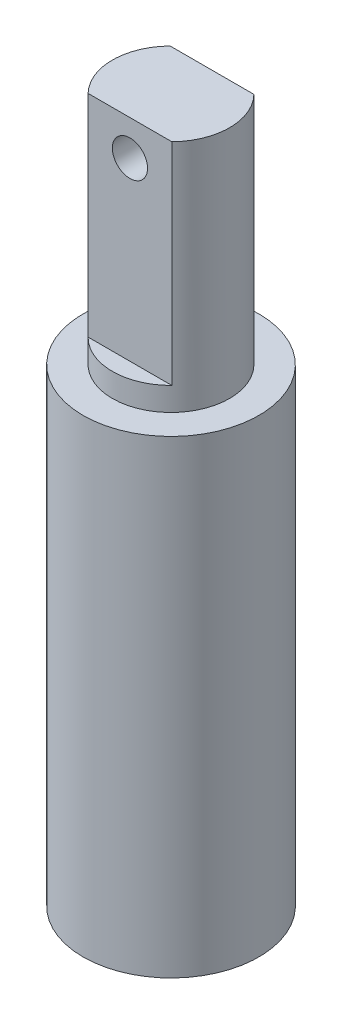
ISO-10303-21;
HEADER;
FILE_DESCRIPTION(('STEP AP214'),'2;1');
FILE_NAME('part.step','',(''),(''),'','','');
FILE_SCHEMA(('AUTOMOTIVE_DESIGN { 1 0 10303 214 1 1 1 1 }'));
ENDSEC;
DATA;
#1=APPLICATION_CONTEXT('core data for automotive mechanical design processes');
#2=APPLICATION_PROTOCOL_DEFINITION('international standard','automotive_design',2000,#1);
#3=PRODUCT_CONTEXT('',#1,'mechanical');
#4=PRODUCT('Part','Part','',(#3));
#5=PRODUCT_RELATED_PRODUCT_CATEGORY('part','',(#4));
#6=PRODUCT_DEFINITION_FORMATION('','',#4);
#7=PRODUCT_DEFINITION_CONTEXT('part definition',#1,'design');
#8=PRODUCT_DEFINITION('design','',#6,#7);
#9=PRODUCT_DEFINITION_SHAPE('','',#8);
#10=(LENGTH_UNIT() NAMED_UNIT(*) SI_UNIT(.MILLI.,.METRE.));
#11=(NAMED_UNIT(*) PLANE_ANGLE_UNIT() SI_UNIT($,.RADIAN.));
#12=(NAMED_UNIT(*) SI_UNIT($,.STERADIAN.) SOLID_ANGLE_UNIT());
#13=UNCERTAINTY_MEASURE_WITH_UNIT(LENGTH_MEASURE(1.E-05),#10,'distance_accuracy_value','');
#14=(GEOMETRIC_REPRESENTATION_CONTEXT(3) GLOBAL_UNCERTAINTY_ASSIGNED_CONTEXT((#13)) GLOBAL_UNIT_ASSIGNED_CONTEXT((#10,
#11,#12)) REPRESENTATION_CONTEXT('',''));
#15=CARTESIAN_POINT('',(0.,0.,0.));
#16=DIRECTION('',(0.,0.,1.));
#17=DIRECTION('',(1.,0.,0.));
#18=AXIS2_PLACEMENT_3D('',#15,#16,#17);
#19=CARTESIAN_POINT('',(0.,60.,0.));
#20=DIRECTION('',(0.,-1.,0.));
#21=DIRECTION('',(0.,0.,-1.));
#22=AXIS2_PLACEMENT_3D('',#19,#20,#21);
#23=CYLINDRICAL_SURFACE('',#22,5.);
#24=CARTESIAN_POINT('',(0.,40.,0.));
#25=DIRECTION('',(0.,1.,0.));
#26=DIRECTION('',(0.,0.,1.));
#27=AXIS2_PLACEMENT_3D('',#24,#25,#26);
#28=CIRCLE('',#27,5.);
#29=CARTESIAN_POINT('',(0.,40.,5.));
#30=VERTEX_POINT('',#29);
#31=EDGE_CURVE('E135',#30,#30,#28,.T.);
#32=ORIENTED_EDGE('',*,*,#31,.T.);
#33=EDGE_LOOP('',(#32));
#34=FACE_BOUND('',#33,.T.);
#35=DIRECTION('',(0.,-1.,0.));
#36=VECTOR('',#35,1.);
#37=CARTESIAN_POINT('',(3.57071421427142,60.,-3.5));
#38=LINE('',#37,#36);
#39=CARTESIAN_POINT('',(3.57071421427142,60.,-3.5));
#40=VERTEX_POINT('',#39);
#41=CARTESIAN_POINT('',(3.57071421427142,42.,-3.5));
#42=VERTEX_POINT('',#41);
#43=EDGE_CURVE('E121',#40,#42,#38,.T.);
#44=ORIENTED_EDGE('',*,*,#43,.F.);
#45=CARTESIAN_POINT('',(0.,60.,0.));
#46=DIRECTION('',(0.,1.,0.));
#47=DIRECTION('',(0.,0.,1.));
#48=AXIS2_PLACEMENT_3D('',#45,#46,#47);
#49=CIRCLE('',#48,5.);
#50=CARTESIAN_POINT('',(3.57071421427142,60.,3.5));
#51=VERTEX_POINT('',#50);
#52=EDGE_CURVE('E104',#51,#40,#49,.T.);
#53=ORIENTED_EDGE('',*,*,#52,.F.);
#54=DIRECTION('',(0.,-1.,0.));
#55=VECTOR('',#54,1.);
#56=CARTESIAN_POINT('',(3.57071421427142,60.,3.5));
#57=LINE('',#56,#55);
#58=CARTESIAN_POINT('',(3.57071421427142,42.,3.5));
#59=VERTEX_POINT('',#58);
#60=EDGE_CURVE('E76',#59,#51,#57,.F.);
#61=ORIENTED_EDGE('',*,*,#60,.F.);
#62=CARTESIAN_POINT('',(0.,42.,0.));
#63=DIRECTION('',(0.,1.,0.));
#64=DIRECTION('',(0.,0.,1.));
#65=AXIS2_PLACEMENT_3D('',#62,#63,#64);
#66=CIRCLE('',#65,5.);
#67=CARTESIAN_POINT('',(-3.57071421427142,42.,3.5));
#68=VERTEX_POINT('',#67);
#69=EDGE_CURVE('E61',#68,#59,#66,.T.);
#70=ORIENTED_EDGE('',*,*,#69,.F.);
#71=DIRECTION('',(0.,-1.,0.));
#72=VECTOR('',#71,1.);
#73=CARTESIAN_POINT('',(-3.57071421427142,60.,3.5));
#74=LINE('',#73,#72);
#75=CARTESIAN_POINT('',(-3.57071421427142,60.,3.5));
#76=VERTEX_POINT('',#75);
#77=EDGE_CURVE('E108',#76,#68,#74,.T.);
#78=ORIENTED_EDGE('',*,*,#77,.F.);
#79=CARTESIAN_POINT('',(-3.57071421427142,60.,-3.5));
#80=VERTEX_POINT('',#79);
#81=EDGE_CURVE('E96',#80,#76,#49,.T.);
#82=ORIENTED_EDGE('',*,*,#81,.F.);
#83=DIRECTION('',(0.,-1.,0.));
#84=VECTOR('',#83,1.);
#85=CARTESIAN_POINT('',(-3.57071421427142,60.,-3.5));
#86=LINE('',#85,#84);
#87=CARTESIAN_POINT('',(-3.57071421427142,42.,-3.5));
#88=VERTEX_POINT('',#87);
#89=EDGE_CURVE('E68',#88,#80,#86,.F.);
#90=ORIENTED_EDGE('',*,*,#89,.F.);
#91=EDGE_CURVE('E12',#42,#88,#66,.T.);
#92=ORIENTED_EDGE('',*,*,#91,.F.);
#93=EDGE_LOOP('',(#44,#53,#61,#70,#78,#82,#90,#92));
#94=FACE_BOUND('',#93,.T.);
#95=ADVANCED_FACE('F51',(#34,#94),#23,.T.);
#96=CARTESIAN_POINT('',(0.,60.,0.));
#97=DIRECTION('',(0.,1.,0.));
#98=DIRECTION('',(0.,0.,1.));
#99=AXIS2_PLACEMENT_3D('',#96,#97,#98);
#100=PLANE('',#99);
#101=ORIENTED_EDGE('',*,*,#52,.T.);
#102=DIRECTION('',(-1.,0.,0.));
#103=VECTOR('',#102,1.);
#104=CARTESIAN_POINT('',(0.,60.,-3.5));
#105=LINE('',#104,#103);
#106=EDGE_CURVE('E100',#40,#80,#105,.T.);
#107=ORIENTED_EDGE('',*,*,#106,.T.);
#108=ORIENTED_EDGE('',*,*,#81,.T.);
#109=DIRECTION('',(1.,0.,0.));
#110=VECTOR('',#109,1.);
#111=CARTESIAN_POINT('',(0.,60.,3.5));
#112=LINE('',#111,#110);
#113=EDGE_CURVE('E98',#76,#51,#112,.T.);
#114=ORIENTED_EDGE('',*,*,#113,.T.);
#115=EDGE_LOOP('',(#101,#107,#108,#114));
#116=FACE_BOUND('',#115,.T.);
#117=ADVANCED_FACE('F97',(#116),#100,.T.);
#118=CARTESIAN_POINT('',(0.,40.,0.));
#119=DIRECTION('',(0.,-1.,0.));
#120=DIRECTION('',(0.,0.,-1.));
#121=AXIS2_PLACEMENT_3D('',#118,#119,#120);
#122=CYLINDRICAL_SURFACE('',#121,5.);
#123=CARTESIAN_POINT('',(0.,0.,0.));
#124=DIRECTION('',(0.,1.,0.));
#125=DIRECTION('',(0.,0.,1.));
#126=AXIS2_PLACEMENT_3D('',#123,#124,#125);
#127=CIRCLE('',#126,5.);
#128=CARTESIAN_POINT('',(0.,0.,5.));
#129=VERTEX_POINT('',#128);
#130=EDGE_CURVE('E131',#129,#129,#127,.T.);
#131=ORIENTED_EDGE('',*,*,#130,.F.);
#132=EDGE_LOOP('',(#131));
#133=FACE_BOUND('',#132,.T.);
#134=CARTESIAN_POINT('',(0.,10.,0.));
#135=DIRECTION('',(0.,1.,0.));
#136=DIRECTION('',(0.,0.,1.));
#137=AXIS2_PLACEMENT_3D('',#134,#135,#136);
#138=CIRCLE('',#137,5.);
#139=CARTESIAN_POINT('',(0.,10.,5.));
#140=VERTEX_POINT('',#139);
#141=EDGE_CURVE('E105',#140,#140,#138,.T.);
#142=ORIENTED_EDGE('',*,*,#141,.T.);
#143=EDGE_LOOP('',(#142));
#144=FACE_BOUND('',#143,.T.);
#145=ADVANCED_FACE('F191',(#133,#144),#122,.F.);
#146=CARTESIAN_POINT('',(0.,40.,0.));
#147=DIRECTION('',(0.,1.,0.));
#148=DIRECTION('',(0.,0.,1.));
#149=AXIS2_PLACEMENT_3D('',#146,#147,#148);
#150=PLANE('',#149);
#151=CARTESIAN_POINT('',(0.,40.,0.));
#152=DIRECTION('',(0.,1.,0.));
#153=DIRECTION('',(0.,0.,1.));
#154=AXIS2_PLACEMENT_3D('',#151,#152,#153);
#155=CIRCLE('',#154,7.5);
#156=CARTESIAN_POINT('',(0.,40.,7.5));
#157=VERTEX_POINT('',#156);
#158=EDGE_CURVE('E111',#157,#157,#155,.T.);
#159=ORIENTED_EDGE('',*,*,#158,.T.);
#160=EDGE_LOOP('',(#159));
#161=FACE_BOUND('',#160,.T.);
#162=ORIENTED_EDGE('',*,*,#31,.F.);
#163=EDGE_LOOP('',(#162));
#164=FACE_BOUND('',#163,.T.);
#165=ADVANCED_FACE('F198',(#161,#164),#150,.T.);
#166=CARTESIAN_POINT('',(0.,0.,0.));
#167=DIRECTION('',(0.,1.,0.));
#168=DIRECTION('',(0.,0.,1.));
#169=AXIS2_PLACEMENT_3D('',#166,#167,#168);
#170=PLANE('',#169);
#171=CARTESIAN_POINT('',(0.,0.,0.));
#172=DIRECTION('',(0.,1.,0.));
#173=DIRECTION('',(0.,0.,1.));
#174=AXIS2_PLACEMENT_3D('',#171,#172,#173);
#175=CIRCLE('',#174,7.5);
#176=CARTESIAN_POINT('',(0.,0.,7.5));
#177=VERTEX_POINT('',#176);
#178=EDGE_CURVE('E139',#177,#177,#175,.T.);
#179=ORIENTED_EDGE('',*,*,#178,.F.);
#180=EDGE_LOOP('',(#179));
#181=FACE_BOUND('',#180,.T.);
#182=ORIENTED_EDGE('',*,*,#130,.T.);
#183=EDGE_LOOP('',(#182));
#184=FACE_BOUND('',#183,.T.);
#185=ADVANCED_FACE('F201',(#181,#184),#170,.F.);
#186=CARTESIAN_POINT('',(0.,40.,0.));
#187=DIRECTION('',(0.,-1.,0.));
#188=DIRECTION('',(0.,0.,-1.));
#189=AXIS2_PLACEMENT_3D('',#186,#187,#188);
#190=CYLINDRICAL_SURFACE('',#189,7.5);
#191=ORIENTED_EDGE('',*,*,#158,.F.);
#192=EDGE_LOOP('',(#191));
#193=FACE_BOUND('',#192,.T.);
#194=ORIENTED_EDGE('',*,*,#178,.T.);
#195=EDGE_LOOP('',(#194));
#196=FACE_BOUND('',#195,.T.);
#197=ADVANCED_FACE('F53',(#193,#196),#190,.T.);
#198=CARTESIAN_POINT('',(0.,10.,0.));
#199=DIRECTION('',(0.,1.,0.));
#200=DIRECTION('',(0.,0.,1.));
#201=AXIS2_PLACEMENT_3D('',#198,#199,#200);
#202=PLANE('',#201);
#203=ORIENTED_EDGE('',*,*,#141,.F.);
#204=EDGE_LOOP('',(#203));
#205=FACE_BOUND('',#204,.T.);
#206=ADVANCED_FACE('F195',(#205),#202,.F.);
#207=CARTESIAN_POINT('',(5.,42.,3.5));
#208=DIRECTION('',(0.,0.,1.));
#209=DIRECTION('',(1.,0.,0.));
#210=AXIS2_PLACEMENT_3D('',#207,#208,#209);
#211=PLANE('',#210);
#212=CARTESIAN_POINT('',(0.,57.,3.5));
#213=DIRECTION('',(0.,0.,1.));
#214=DIRECTION('',(1.,0.,0.));
#215=AXIS2_PLACEMENT_3D('',#212,#213,#214);
#216=CIRCLE('',#215,1.5);
#217=CARTESIAN_POINT('',(1.5,57.,3.5));
#218=VERTEX_POINT('',#217);
#219=EDGE_CURVE('E164',#218,#218,#216,.T.);
#220=ORIENTED_EDGE('',*,*,#219,.F.);
#221=EDGE_LOOP('',(#220));
#222=FACE_BOUND('',#221,.T.);
#223=ORIENTED_EDGE('',*,*,#77,.T.);
#224=DIRECTION('',(1.,0.,0.));
#225=VECTOR('',#224,1.);
#226=CARTESIAN_POINT('',(5.,42.,3.5));
#227=LINE('',#226,#225);
#228=EDGE_CURVE('E153',#68,#59,#227,.T.);
#229=ORIENTED_EDGE('',*,*,#228,.T.);
#230=ORIENTED_EDGE('',*,*,#60,.T.);
#231=ORIENTED_EDGE('',*,*,#113,.F.);
#232=EDGE_LOOP('',(#223,#229,#230,#231));
#233=FACE_BOUND('',#232,.T.);
#234=ADVANCED_FACE('F107',(#222,#233),#211,.T.);
#235=CARTESIAN_POINT('',(0.,42.,0.));
#236=DIRECTION('',(0.,1.,0.));
#237=DIRECTION('',(0.,0.,1.));
#238=AXIS2_PLACEMENT_3D('',#235,#236,#237);
#239=PLANE('',#238);
#240=ORIENTED_EDGE('',*,*,#69,.T.);
#241=ORIENTED_EDGE('',*,*,#228,.F.);
#242=EDGE_LOOP('',(#240,#241));
#243=FACE_BOUND('',#242,.T.);
#244=ADVANCED_FACE('F152',(#243),#239,.T.);
#245=ORIENTED_EDGE('',*,*,#91,.T.);
#246=DIRECTION('',(-1.,0.,0.));
#247=VECTOR('',#246,1.);
#248=CARTESIAN_POINT('',(5.,42.,-3.5));
#249=LINE('',#248,#247);
#250=EDGE_CURVE('E124',#42,#88,#249,.T.);
#251=ORIENTED_EDGE('',*,*,#250,.F.);
#252=EDGE_LOOP('',(#245,#251));
#253=FACE_BOUND('',#252,.T.);
#254=ADVANCED_FACE('F160',(#253),#239,.T.);
#255=CARTESIAN_POINT('',(5.,42.,-3.5));
#256=DIRECTION('',(0.,0.,-1.));
#257=DIRECTION('',(-1.,0.,0.));
#258=AXIS2_PLACEMENT_3D('',#255,#256,#257);
#259=PLANE('',#258);
#260=CARTESIAN_POINT('',(0.,57.,-3.5));
#261=DIRECTION('',(0.,0.,-1.));
#262=DIRECTION('',(-1.,0.,0.));
#263=AXIS2_PLACEMENT_3D('',#260,#261,#262);
#264=CIRCLE('',#263,1.5);
#265=CARTESIAN_POINT('',(-1.5,57.,-3.5));
#266=VERTEX_POINT('',#265);
#267=EDGE_CURVE('E55',#266,#266,#264,.T.);
#268=ORIENTED_EDGE('',*,*,#267,.F.);
#269=EDGE_LOOP('',(#268));
#270=FACE_BOUND('',#269,.T.);
#271=ORIENTED_EDGE('',*,*,#43,.T.);
#272=ORIENTED_EDGE('',*,*,#250,.T.);
#273=ORIENTED_EDGE('',*,*,#89,.T.);
#274=ORIENTED_EDGE('',*,*,#106,.F.);
#275=EDGE_LOOP('',(#271,#272,#273,#274));
#276=FACE_BOUND('',#275,.T.);
#277=ADVANCED_FACE('F157',(#270,#276),#259,.T.);
#278=CARTESIAN_POINT('',(0.,57.,-6.5));
#279=DIRECTION('',(0.,0.,1.));
#280=DIRECTION('',(1.,0.,0.));
#281=AXIS2_PLACEMENT_3D('',#278,#279,#280);
#282=CYLINDRICAL_SURFACE('',#281,1.5);
#283=ORIENTED_EDGE('',*,*,#267,.T.);
#284=EDGE_LOOP('',(#283));
#285=FACE_BOUND('',#284,.T.);
#286=ORIENTED_EDGE('',*,*,#219,.T.);
#287=EDGE_LOOP('',(#286));
#288=FACE_BOUND('',#287,.T.);
#289=ADVANCED_FACE('F174',(#285,#288),#282,.F.);
#290=CLOSED_SHELL('',(#95,#117,#145,#165,#185,#197,#206,#234,#244,#254,#277,#289));
#291=MANIFOLD_SOLID_BREP('B2',#290);
#292=ADVANCED_BREP_SHAPE_REPRESENTATION('',(#18,#291),#14);
#293=SHAPE_DEFINITION_REPRESENTATION(#9,#292);
ENDSEC;
END-ISO-10303-21;
